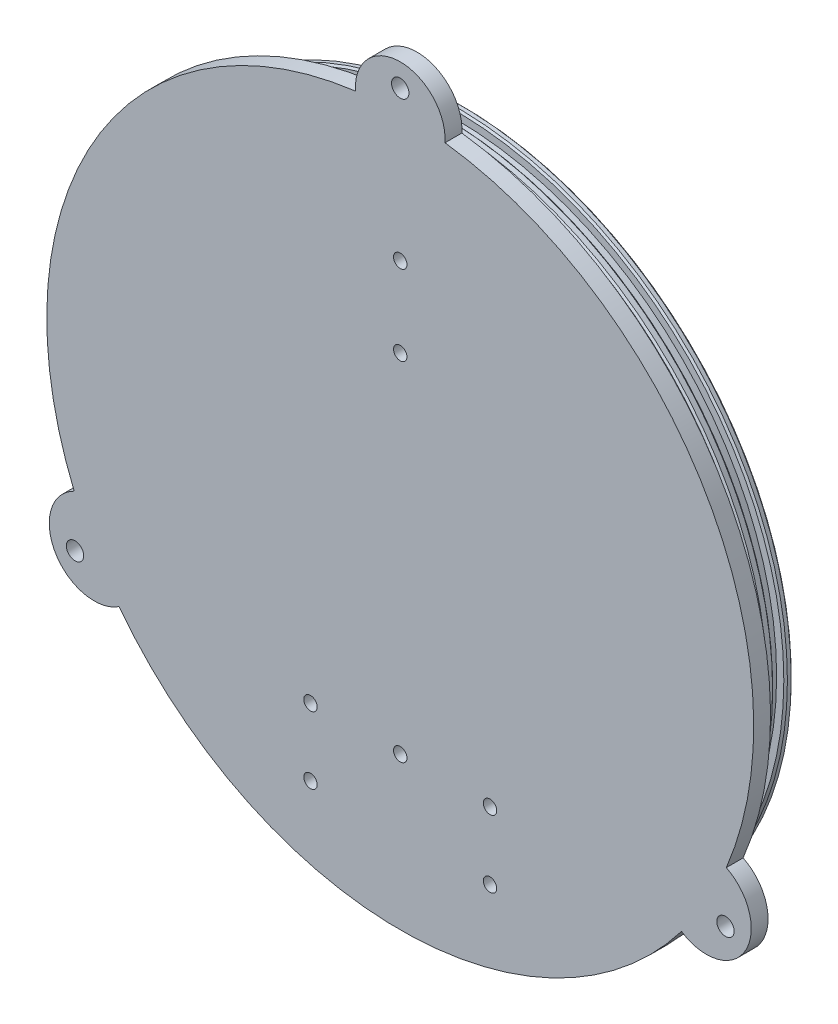
ISO-10303-21;
HEADER;
FILE_DESCRIPTION(('STEP AP214'),'2;1');
FILE_NAME('part.step','',(''),(''),'','','');
FILE_SCHEMA(('AUTOMOTIVE_DESIGN { 1 0 10303 214 1 1 1 1 }'));
ENDSEC;
DATA;
#1=APPLICATION_CONTEXT('core data for automotive mechanical design processes');
#2=APPLICATION_PROTOCOL_DEFINITION('international standard','automotive_design',2000,#1);
#3=PRODUCT_CONTEXT('',#1,'mechanical');
#4=PRODUCT('Part','Part','',(#3));
#5=PRODUCT_RELATED_PRODUCT_CATEGORY('part','',(#4));
#6=PRODUCT_DEFINITION_FORMATION('','',#4);
#7=PRODUCT_DEFINITION_CONTEXT('part definition',#1,'design');
#8=PRODUCT_DEFINITION('design','',#6,#7);
#9=PRODUCT_DEFINITION_SHAPE('','',#8);
#10=(LENGTH_UNIT() NAMED_UNIT(*) SI_UNIT(.MILLI.,.METRE.));
#11=(NAMED_UNIT(*) PLANE_ANGLE_UNIT() SI_UNIT($,.RADIAN.));
#12=(NAMED_UNIT(*) SI_UNIT($,.STERADIAN.) SOLID_ANGLE_UNIT());
#13=UNCERTAINTY_MEASURE_WITH_UNIT(LENGTH_MEASURE(1.E-05),#10,'distance_accuracy_value','');
#14=(GEOMETRIC_REPRESENTATION_CONTEXT(3) GLOBAL_UNCERTAINTY_ASSIGNED_CONTEXT((#13)) GLOBAL_UNIT_ASSIGNED_CONTEXT((#10,
#11,#12)) REPRESENTATION_CONTEXT('',''));
#15=CARTESIAN_POINT('',(0.,0.,0.));
#16=DIRECTION('',(0.,0.,1.));
#17=DIRECTION('',(1.,0.,0.));
#18=AXIS2_PLACEMENT_3D('',#15,#16,#17);
#19=CARTESIAN_POINT('',(0.,0.,4.7625));
#20=DIRECTION('',(0.,0.,-1.));
#21=DIRECTION('',(-1.,0.,0.));
#22=AXIS2_PLACEMENT_3D('',#19,#20,#21);
#23=CYLINDRICAL_SURFACE('',#22,100.0125);
#24=CARTESIAN_POINT('',(0.,0.,0.));
#25=DIRECTION('',(0.,0.,1.));
#26=DIRECTION('',(1.,0.,0.));
#27=AXIS2_PLACEMENT_3D('',#24,#25,#26);
#28=CIRCLE('',#27,100.0125);
#29=CARTESIAN_POINT('',(-12.6743757620413,99.2061507936508,0.));
#30=VERTEX_POINT('',#29);
#31=CARTESIAN_POINT('',(-92.252234679992,-38.6267440097877,0.));
#32=VERTEX_POINT('',#31);
#33=EDGE_CURVE('E103',#30,#32,#28,.T.);
#34=ORIENTED_EDGE('',*,*,#33,.T.);
#35=DIRECTION('',(0.,0.,1.));
#36=VECTOR('',#35,1.);
#37=CARTESIAN_POINT('',(-92.252234679992,-38.6267440097877,-31.1337893054916));
#38=LINE('',#37,#36);
#39=CARTESIAN_POINT('',(-92.252234679992,-38.6267440097877,4.7625));
#40=VERTEX_POINT('',#39);
#41=EDGE_CURVE('E91',#32,#40,#38,.T.);
#42=ORIENTED_EDGE('',*,*,#41,.T.);
#43=CARTESIAN_POINT('',(0.,0.,4.7625));
#44=DIRECTION('',(0.,0.,1.));
#45=DIRECTION('',(1.,0.,0.));
#46=AXIS2_PLACEMENT_3D('',#43,#44,#45);
#47=CIRCLE('',#46,100.0125);
#48=CARTESIAN_POINT('',(-12.6743757620412,99.2061507936508,4.7625));
#49=VERTEX_POINT('',#48);
#50=EDGE_CURVE('E101',#49,#40,#47,.T.);
#51=ORIENTED_EDGE('',*,*,#50,.F.);
#52=DIRECTION('',(0.,0.,1.));
#53=VECTOR('',#52,1.);
#54=CARTESIAN_POINT('',(-12.6743757620413,99.2061507936508,-31.1337893054916));
#55=LINE('',#54,#53);
#56=EDGE_CURVE('E148',#30,#49,#55,.T.);
#57=ORIENTED_EDGE('',*,*,#56,.F.);
#58=EDGE_LOOP('',(#34,#42,#51,#57));
#59=FACE_BOUND('',#58,.T.);
#60=ADVANCED_FACE('F36',(#59),#23,.T.);
#61=CARTESIAN_POINT('',(-79.5778589179509,-60.5794067838627,4.7625));
#62=VERTEX_POINT('',#61);
#63=CARTESIAN_POINT('',(79.5778589179508,-60.5794067838627,4.7625));
#64=VERTEX_POINT('',#63);
#65=EDGE_CURVE('E110',#62,#64,#47,.T.);
#66=ORIENTED_EDGE('',*,*,#65,.F.);
#67=DIRECTION('',(0.,0.,1.));
#68=VECTOR('',#67,1.);
#69=CARTESIAN_POINT('',(-79.5778589179508,-60.5794067838627,-31.1337893054916));
#70=LINE('',#69,#68);
#71=CARTESIAN_POINT('',(-79.5778589179508,-60.5794067838627,0.));
#72=VERTEX_POINT('',#71);
#73=EDGE_CURVE('E94',#72,#62,#70,.T.);
#74=ORIENTED_EDGE('',*,*,#73,.F.);
#75=CARTESIAN_POINT('',(79.5778589179508,-60.5794067838627,0.));
#76=VERTEX_POINT('',#75);
#77=EDGE_CURVE('E118',#72,#76,#28,.T.);
#78=ORIENTED_EDGE('',*,*,#77,.T.);
#79=DIRECTION('',(0.,0.,1.));
#80=VECTOR('',#79,1.);
#81=CARTESIAN_POINT('',(79.5778589179508,-60.5794067838627,-31.1337893054916));
#82=LINE('',#81,#80);
#83=EDGE_CURVE('E157',#76,#64,#82,.T.);
#84=ORIENTED_EDGE('',*,*,#83,.T.);
#85=EDGE_LOOP('',(#66,#74,#78,#84));
#86=FACE_BOUND('',#85,.T.);
#87=ADVANCED_FACE('F285',(#86),#23,.T.);
#88=CARTESIAN_POINT('',(0.,0.,-12.7));
#89=DIRECTION('',(0.,0.,1.));
#90=DIRECTION('',(1.,0.,0.));
#91=AXIS2_PLACEMENT_3D('',#88,#89,#90);
#92=CYLINDRICAL_SURFACE('',#91,93.6625);
#93=CARTESIAN_POINT('',(0.,0.,-6.93292340913388));
#94=DIRECTION('',(0.,0.,-1.));
#95=DIRECTION('',(-1.,0.,0.));
#96=AXIS2_PLACEMENT_3D('',#93,#94,#95);
#97=CIRCLE('',#96,93.6625);
#98=CARTESIAN_POINT('',(-93.6625,0.,-6.93292340913388));
#99=VERTEX_POINT('',#98);
#100=EDGE_CURVE('E365',#99,#99,#97,.F.);
#101=ORIENTED_EDGE('',*,*,#100,.T.);
#102=EDGE_LOOP('',(#101));
#103=FACE_BOUND('',#102,.T.);
#104=CARTESIAN_POINT('',(0.,0.,-5.49135892581057));
#105=DIRECTION('',(0.,0.,1.));
#106=DIRECTION('',(1.,0.,0.));
#107=AXIS2_PLACEMENT_3D('',#104,#105,#106);
#108=CIRCLE('',#107,93.6625);
#109=CARTESIAN_POINT('',(93.6625,0.,-5.49135892581057));
#110=VERTEX_POINT('',#109);
#111=EDGE_CURVE('E362',#110,#110,#108,.F.);
#112=ORIENTED_EDGE('',*,*,#111,.T.);
#113=EDGE_LOOP('',(#112));
#114=FACE_BOUND('',#113,.T.);
#115=ADVANCED_FACE('F278',(#103,#114),#92,.T.);
#116=CARTESIAN_POINT('',(0.,0.,-1.30035892581059));
#117=DIRECTION('',(0.,0.,-1.));
#118=DIRECTION('',(-1.,0.,0.));
#119=AXIS2_PLACEMENT_3D('',#116,#117,#118);
#120=CIRCLE('',#119,93.6625);
#121=CARTESIAN_POINT('',(-93.6625,0.,-1.30035892581059));
#122=VERTEX_POINT('',#121);
#123=EDGE_CURVE('E45',#122,#122,#120,.F.);
#124=ORIENTED_EDGE('',*,*,#123,.T.);
#125=EDGE_LOOP('',(#124));
#126=FACE_BOUND('',#125,.T.);
#127=CARTESIAN_POINT('',(0.,0.,0.));
#128=DIRECTION('',(0.,0.,1.));
#129=DIRECTION('',(1.,0.,0.));
#130=AXIS2_PLACEMENT_3D('',#127,#128,#129);
#131=CIRCLE('',#130,93.6625);
#132=CARTESIAN_POINT('',(93.6625,0.,0.));
#133=VERTEX_POINT('',#132);
#134=EDGE_CURVE('E109',#133,#133,#131,.F.);
#135=ORIENTED_EDGE('',*,*,#134,.T.);
#136=EDGE_LOOP('',(#135));
#137=FACE_BOUND('',#136,.T.);
#138=ADVANCED_FACE('F271',(#126,#137),#92,.T.);
#139=CARTESIAN_POINT('',(0.,0.,0.));
#140=DIRECTION('',(0.,0.,1.));
#141=DIRECTION('',(1.,0.,0.));
#142=AXIS2_PLACEMENT_3D('',#139,#140,#141);
#143=PLANE('',#142);
#144=CARTESIAN_POINT('',(0.,106.255823369828,0.));
#145=DIRECTION('',(0.,0.,1.));
#146=DIRECTION('',(1.,0.,0.));
#147=AXIS2_PLACEMENT_3D('',#144,#145,#146);
#148=CIRCLE('',#147,2.45744999999997);
#149=CARTESIAN_POINT('',(2.45744999999997,106.255823369828,0.));
#150=VERTEX_POINT('',#149);
#151=EDGE_CURVE('E176',#150,#150,#148,.T.);
#152=ORIENTED_EDGE('',*,*,#151,.T.);
#153=EDGE_LOOP('',(#152));
#154=FACE_BOUND('',#153,.T.);
#155=CARTESIAN_POINT('',(-92.0202423383029,-53.1279116849138,0.));
#156=DIRECTION('',(0.,0.,1.));
#157=DIRECTION('',(1.,0.,0.));
#158=AXIS2_PLACEMENT_3D('',#155,#156,#157);
#159=CIRCLE('',#158,2.45744999999997);
#160=CARTESIAN_POINT('',(-89.562792338303,-53.1279116849138,0.));
#161=VERTEX_POINT('',#160);
#162=EDGE_CURVE('E170',#161,#161,#159,.T.);
#163=ORIENTED_EDGE('',*,*,#162,.T.);
#164=EDGE_LOOP('',(#163));
#165=FACE_BOUND('',#164,.T.);
#166=CARTESIAN_POINT('',(92.0202423383029,-53.1279116849139,0.));
#167=DIRECTION('',(0.,0.,1.));
#168=DIRECTION('',(1.,0.,0.));
#169=AXIS2_PLACEMENT_3D('',#166,#167,#168);
#170=CIRCLE('',#169,2.45744999999997);
#171=CARTESIAN_POINT('',(94.4776923383029,-53.1279116849139,0.));
#172=VERTEX_POINT('',#171);
#173=EDGE_CURVE('E96',#172,#172,#170,.T.);
#174=ORIENTED_EDGE('',*,*,#173,.T.);
#175=EDGE_LOOP('',(#174));
#176=FACE_BOUND('',#175,.T.);
#177=ORIENTED_EDGE('',*,*,#33,.F.);
#178=CARTESIAN_POINT('',(0.,100.0125,0.));
#179=DIRECTION('',(0.,0.,1.));
#180=DIRECTION('',(1.,0.,0.));
#181=AXIS2_PLACEMENT_3D('',#178,#179,#180);
#182=CIRCLE('',#181,12.7);
#183=CARTESIAN_POINT('',(12.6743757620413,99.2061507936508,0.));
#184=VERTEX_POINT('',#183);
#185=EDGE_CURVE('E146',#30,#184,#182,.F.);
#186=ORIENTED_EDGE('',*,*,#185,.T.);
#187=CARTESIAN_POINT('',(92.2522346799921,-38.6267440097876,0.));
#188=VERTEX_POINT('',#187);
#189=EDGE_CURVE('E119',#188,#184,#28,.T.);
#190=ORIENTED_EDGE('',*,*,#189,.F.);
#191=CARTESIAN_POINT('',(86.6133656959913,-50.0062499999998,0.));
#192=DIRECTION('',(0.,0.,1.));
#193=DIRECTION('',(1.,0.,0.));
#194=AXIS2_PLACEMENT_3D('',#191,#192,#193);
#195=CIRCLE('',#194,12.7);
#196=EDGE_CURVE('E153',#188,#76,#195,.F.);
#197=ORIENTED_EDGE('',*,*,#196,.T.);
#198=ORIENTED_EDGE('',*,*,#77,.F.);
#199=CARTESIAN_POINT('',(-86.6133656959913,-50.0062499999998,0.));
#200=DIRECTION('',(0.,0.,1.));
#201=DIRECTION('',(1.,0.,0.));
#202=AXIS2_PLACEMENT_3D('',#199,#200,#201);
#203=CIRCLE('',#202,12.7);
#204=EDGE_CURVE('E162',#72,#32,#203,.F.);
#205=ORIENTED_EDGE('',*,*,#204,.T.);
#206=EDGE_LOOP('',(#177,#186,#190,#197,#198,#205));
#207=FACE_BOUND('',#206,.T.);
#208=ORIENTED_EDGE('',*,*,#134,.F.);
#209=EDGE_LOOP('',(#208));
#210=FACE_BOUND('',#209,.T.);
#211=ADVANCED_FACE('F268',(#154,#165,#176,#207,#210),#143,.F.);
#212=CARTESIAN_POINT('',(92.252234679992,-38.6267440097877,4.7625));
#213=VERTEX_POINT('',#212);
#214=CARTESIAN_POINT('',(12.6743757620413,99.2061507936508,4.7625));
#215=VERTEX_POINT('',#214);
#216=EDGE_CURVE('E112',#213,#215,#47,.T.);
#217=ORIENTED_EDGE('',*,*,#216,.F.);
#218=DIRECTION('',(0.,0.,1.));
#219=VECTOR('',#218,1.);
#220=CARTESIAN_POINT('',(92.2522346799921,-38.6267440097876,-31.1337893054916));
#221=LINE('',#220,#219);
#222=EDGE_CURVE('E156',#188,#213,#221,.T.);
#223=ORIENTED_EDGE('',*,*,#222,.F.);
#224=ORIENTED_EDGE('',*,*,#189,.T.);
#225=DIRECTION('',(0.,0.,1.));
#226=VECTOR('',#225,1.);
#227=CARTESIAN_POINT('',(12.6743757620413,99.2061507936508,-31.1337893054916));
#228=LINE('',#227,#226);
#229=EDGE_CURVE('E149',#184,#215,#228,.T.);
#230=ORIENTED_EDGE('',*,*,#229,.T.);
#231=EDGE_LOOP('',(#217,#223,#224,#230));
#232=FACE_BOUND('',#231,.T.);
#233=ADVANCED_FACE('F38',(#232),#23,.T.);
#234=CARTESIAN_POINT('',(0.,0.,4.7625));
#235=DIRECTION('',(0.,0.,1.));
#236=DIRECTION('',(1.,0.,0.));
#237=AXIS2_PLACEMENT_3D('',#234,#235,#236);
#238=PLANE('',#237);
#239=CARTESIAN_POINT('',(25.4,-57.15,4.7625));
#240=DIRECTION('',(0.,0.,1.));
#241=DIRECTION('',(1.,0.,0.));
#242=AXIS2_PLACEMENT_3D('',#239,#240,#241);
#243=CIRCLE('',#242,1.89865);
#244=CARTESIAN_POINT('',(27.29865,-57.15,4.7625));
#245=VERTEX_POINT('',#244);
#246=EDGE_CURVE('E205',#245,#245,#243,.T.);
#247=ORIENTED_EDGE('',*,*,#246,.F.);
#248=EDGE_LOOP('',(#247));
#249=FACE_BOUND('',#248,.T.);
#250=CARTESIAN_POINT('',(-25.4,-57.15,4.7625));
#251=DIRECTION('',(0.,0.,1.));
#252=DIRECTION('',(1.,0.,0.));
#253=AXIS2_PLACEMENT_3D('',#250,#251,#252);
#254=CIRCLE('',#253,1.89865);
#255=CARTESIAN_POINT('',(-23.50135,-57.15,4.7625));
#256=VERTEX_POINT('',#255);
#257=EDGE_CURVE('E199',#256,#256,#254,.T.);
#258=ORIENTED_EDGE('',*,*,#257,.F.);
#259=EDGE_LOOP('',(#258));
#260=FACE_BOUND('',#259,.T.);
#261=CARTESIAN_POINT('',(25.4,-76.2,4.7625));
#262=DIRECTION('',(0.,0.,1.));
#263=DIRECTION('',(1.,0.,0.));
#264=AXIS2_PLACEMENT_3D('',#261,#262,#263);
#265=CIRCLE('',#264,1.89865);
#266=CARTESIAN_POINT('',(27.29865,-76.2,4.7625));
#267=VERTEX_POINT('',#266);
#268=EDGE_CURVE('E40',#267,#267,#265,.T.);
#269=ORIENTED_EDGE('',*,*,#268,.F.);
#270=EDGE_LOOP('',(#269));
#271=FACE_BOUND('',#270,.T.);
#272=CARTESIAN_POINT('',(-25.4,-76.2,4.7625));
#273=DIRECTION('',(0.,0.,1.));
#274=DIRECTION('',(1.,0.,0.));
#275=AXIS2_PLACEMENT_3D('',#272,#273,#274);
#276=CIRCLE('',#275,1.89865);
#277=CARTESIAN_POINT('',(-23.50135,-76.2,4.7625));
#278=VERTEX_POINT('',#277);
#279=EDGE_CURVE('E192',#278,#278,#276,.T.);
#280=ORIENTED_EDGE('',*,*,#279,.F.);
#281=EDGE_LOOP('',(#280));
#282=FACE_BOUND('',#281,.T.);
#283=CARTESIAN_POINT('',(0.,63.9527832109796,4.7625));
#284=DIRECTION('',(0.,0.,1.));
#285=DIRECTION('',(1.,0.,0.));
#286=AXIS2_PLACEMENT_3D('',#283,#284,#285);
#287=CIRCLE('',#286,1.89865);
#288=CARTESIAN_POINT('',(1.89864999999998,63.9527832109796,4.7625));
#289=VERTEX_POINT('',#288);
#290=EDGE_CURVE('E189',#289,#289,#287,.T.);
#291=ORIENTED_EDGE('',*,*,#290,.F.);
#292=EDGE_LOOP('',(#291));
#293=FACE_BOUND('',#292,.T.);
#294=CARTESIAN_POINT('',(0.,41.3467832109796,4.7625));
#295=DIRECTION('',(0.,0.,1.));
#296=DIRECTION('',(1.,0.,0.));
#297=AXIS2_PLACEMENT_3D('',#294,#295,#296);
#298=CIRCLE('',#297,1.89865);
#299=CARTESIAN_POINT('',(1.89864999999997,41.3467832109796,4.7625));
#300=VERTEX_POINT('',#299);
#301=EDGE_CURVE('E185',#300,#300,#298,.T.);
#302=ORIENTED_EDGE('',*,*,#301,.F.);
#303=EDGE_LOOP('',(#302));
#304=FACE_BOUND('',#303,.T.);
#305=CARTESIAN_POINT('',(0.,-56.9512167890204,4.7625));
#306=DIRECTION('',(0.,0.,1.));
#307=DIRECTION('',(1.,0.,0.));
#308=AXIS2_PLACEMENT_3D('',#305,#306,#307);
#309=CIRCLE('',#308,1.89865);
#310=CARTESIAN_POINT('',(1.89864999999991,-56.9512167890204,4.7625));
#311=VERTEX_POINT('',#310);
#312=EDGE_CURVE('E181',#311,#311,#309,.T.);
#313=ORIENTED_EDGE('',*,*,#312,.F.);
#314=EDGE_LOOP('',(#313));
#315=FACE_BOUND('',#314,.T.);
#316=CARTESIAN_POINT('',(0.,106.255823369828,4.7625));
#317=DIRECTION('',(0.,0.,1.));
#318=DIRECTION('',(1.,0.,0.));
#319=AXIS2_PLACEMENT_3D('',#316,#317,#318);
#320=CIRCLE('',#319,2.45744999999999);
#321=CARTESIAN_POINT('',(2.45744999999999,106.255823369828,4.7625));
#322=VERTEX_POINT('',#321);
#323=EDGE_CURVE('E177',#322,#322,#320,.T.);
#324=ORIENTED_EDGE('',*,*,#323,.F.);
#325=EDGE_LOOP('',(#324));
#326=FACE_BOUND('',#325,.T.);
#327=CARTESIAN_POINT('',(-92.0202423383029,-53.1279116849138,4.7625));
#328=DIRECTION('',(0.,0.,1.));
#329=DIRECTION('',(1.,0.,0.));
#330=AXIS2_PLACEMENT_3D('',#327,#328,#329);
#331=CIRCLE('',#330,2.45744999999999);
#332=CARTESIAN_POINT('',(-89.5627923383029,-53.1279116849138,4.7625));
#333=VERTEX_POINT('',#332);
#334=EDGE_CURVE('E173',#333,#333,#331,.T.);
#335=ORIENTED_EDGE('',*,*,#334,.F.);
#336=EDGE_LOOP('',(#335));
#337=FACE_BOUND('',#336,.T.);
#338=CARTESIAN_POINT('',(92.0202423383029,-53.1279116849139,4.7625));
#339=DIRECTION('',(0.,0.,1.));
#340=DIRECTION('',(1.,0.,0.));
#341=AXIS2_PLACEMENT_3D('',#338,#339,#340);
#342=CIRCLE('',#341,2.45744999999999);
#343=CARTESIAN_POINT('',(94.4776923383029,-53.1279116849139,4.7625));
#344=VERTEX_POINT('',#343);
#345=EDGE_CURVE('E167',#344,#344,#342,.T.);
#346=ORIENTED_EDGE('',*,*,#345,.F.);
#347=EDGE_LOOP('',(#346));
#348=FACE_BOUND('',#347,.T.);
#349=ORIENTED_EDGE('',*,*,#50,.T.);
#350=CARTESIAN_POINT('',(-86.6133656959913,-50.0062499999998,4.7625));
#351=DIRECTION('',(0.,0.,1.));
#352=DIRECTION('',(-1.,0.,0.));
#353=AXIS2_PLACEMENT_3D('',#350,#351,#352);
#354=CIRCLE('',#353,12.7);
#355=EDGE_CURVE('E53',#40,#62,#354,.T.);
#356=ORIENTED_EDGE('',*,*,#355,.T.);
#357=ORIENTED_EDGE('',*,*,#65,.T.);
#358=CARTESIAN_POINT('',(86.6133656959913,-50.0062499999998,4.7625));
#359=DIRECTION('',(0.,0.,1.));
#360=DIRECTION('',(-1.,0.,0.));
#361=AXIS2_PLACEMENT_3D('',#358,#359,#360);
#362=CIRCLE('',#361,12.7);
#363=EDGE_CURVE('E59',#64,#213,#362,.T.);
#364=ORIENTED_EDGE('',*,*,#363,.T.);
#365=ORIENTED_EDGE('',*,*,#216,.T.);
#366=CARTESIAN_POINT('',(0.,100.0125,4.7625));
#367=DIRECTION('',(0.,0.,1.));
#368=DIRECTION('',(-1.,0.,0.));
#369=AXIS2_PLACEMENT_3D('',#366,#367,#368);
#370=CIRCLE('',#369,12.7);
#371=EDGE_CURVE('E107',#215,#49,#370,.T.);
#372=ORIENTED_EDGE('',*,*,#371,.T.);
#373=EDGE_LOOP('',(#349,#356,#357,#364,#365,#372));
#374=FACE_BOUND('',#373,.T.);
#375=ADVANCED_FACE('F105',(#249,#260,#271,#282,#293,#304,#315,#326,#337,#348,#374),#238,.T.);
#376=CARTESIAN_POINT('',(0.,93.6625,-1.80835892581058));
#377=DIRECTION('',(0.,0.,-1.));
#378=DIRECTION('',(-1.,0.,0.));
#379=AXIS2_PLACEMENT_3D('',#376,#377,#378);
#380=PLANE('',#379);
#381=CARTESIAN_POINT('',(0.,0.,-1.80835892581058));
#382=DIRECTION('',(0.,0.,-1.));
#383=DIRECTION('',(-1.,0.,0.));
#384=AXIS2_PLACEMENT_3D('',#381,#382,#383);
#385=CIRCLE('',#384,93.1545);
#386=CARTESIAN_POINT('',(-93.1545,0.,-1.80835892581058));
#387=VERTEX_POINT('',#386);
#388=EDGE_CURVE('E11',#387,#387,#385,.T.);
#389=ORIENTED_EDGE('',*,*,#388,.T.);
#390=EDGE_LOOP('',(#389));
#391=FACE_BOUND('',#390,.T.);
#392=CARTESIAN_POINT('',(0.,0.,-1.80835892581058));
#393=DIRECTION('',(0.,0.,1.));
#394=DIRECTION('',(1.,0.,0.));
#395=AXIS2_PLACEMENT_3D('',#392,#393,#394);
#396=CIRCLE('',#395,91.1225);
#397=CARTESIAN_POINT('',(91.1225,0.,-1.80835892581058));
#398=VERTEX_POINT('',#397);
#399=EDGE_CURVE('E132',#398,#398,#396,.T.);
#400=ORIENTED_EDGE('',*,*,#399,.T.);
#401=EDGE_LOOP('',(#400));
#402=FACE_BOUND('',#401,.T.);
#403=ADVANCED_FACE('F247',(#391,#402),#380,.T.);
#404=CARTESIAN_POINT('',(0.,0.,0.));
#405=DIRECTION('',(0.,0.,1.));
#406=DIRECTION('',(1.,0.,0.));
#407=AXIS2_PLACEMENT_3D('',#404,#405,#406);
#408=CYLINDRICAL_SURFACE('',#407,91.1225);
#409=CARTESIAN_POINT('',(0.,0.,-4.98335892581058));
#410=DIRECTION('',(0.,0.,1.));
#411=DIRECTION('',(1.,0.,0.));
#412=AXIS2_PLACEMENT_3D('',#409,#410,#411);
#413=CIRCLE('',#412,91.1225);
#414=CARTESIAN_POINT('',(91.1225,0.,-4.98335892581058));
#415=VERTEX_POINT('',#414);
#416=EDGE_CURVE('E137',#415,#415,#413,.T.);
#417=ORIENTED_EDGE('',*,*,#416,.T.);
#418=EDGE_LOOP('',(#417));
#419=FACE_BOUND('',#418,.T.);
#420=ORIENTED_EDGE('',*,*,#399,.F.);
#421=EDGE_LOOP('',(#420));
#422=FACE_BOUND('',#421,.T.);
#423=ADVANCED_FACE('F330',(#419,#422),#408,.T.);
#424=CARTESIAN_POINT('',(0.,93.6625,-4.98335892581058));
#425=DIRECTION('',(0.,0.,1.));
#426=DIRECTION('',(1.,0.,0.));
#427=AXIS2_PLACEMENT_3D('',#424,#425,#426);
#428=PLANE('',#427);
#429=CARTESIAN_POINT('',(0.,0.,-4.98335892581058));
#430=DIRECTION('',(0.,0.,1.));
#431=DIRECTION('',(1.,0.,0.));
#432=AXIS2_PLACEMENT_3D('',#429,#430,#431);
#433=CIRCLE('',#432,93.1545);
#434=CARTESIAN_POINT('',(93.1545,0.,-4.98335892581058));
#435=VERTEX_POINT('',#434);
#436=EDGE_CURVE('E371',#435,#435,#433,.T.);
#437=ORIENTED_EDGE('',*,*,#436,.T.);
#438=EDGE_LOOP('',(#437));
#439=FACE_BOUND('',#438,.T.);
#440=ORIENTED_EDGE('',*,*,#416,.F.);
#441=EDGE_LOOP('',(#440));
#442=FACE_BOUND('',#441,.T.);
#443=ADVANCED_FACE('F326',(#439,#442),#428,.T.);
#444=CARTESIAN_POINT('',(0.,93.6625,-7.44092340913388));
#445=DIRECTION('',(0.,0.,-1.));
#446=DIRECTION('',(-1.,0.,0.));
#447=AXIS2_PLACEMENT_3D('',#444,#445,#446);
#448=PLANE('',#447);
#449=CARTESIAN_POINT('',(0.,0.,-7.44092340913388));
#450=DIRECTION('',(0.,0.,-1.));
#451=DIRECTION('',(-1.,0.,0.));
#452=AXIS2_PLACEMENT_3D('',#449,#450,#451);
#453=CIRCLE('',#452,93.1545);
#454=CARTESIAN_POINT('',(-93.1545,0.,-7.44092340913388));
#455=VERTEX_POINT('',#454);
#456=EDGE_CURVE('E368',#455,#455,#453,.T.);
#457=ORIENTED_EDGE('',*,*,#456,.T.);
#458=EDGE_LOOP('',(#457));
#459=FACE_BOUND('',#458,.T.);
#460=CARTESIAN_POINT('',(0.,0.,-7.44092340913388));
#461=DIRECTION('',(0.,0.,1.));
#462=DIRECTION('',(1.,0.,0.));
#463=AXIS2_PLACEMENT_3D('',#460,#461,#462);
#464=CIRCLE('',#463,91.1225);
#465=CARTESIAN_POINT('',(91.1225,0.,-7.44092340913388));
#466=VERTEX_POINT('',#465);
#467=EDGE_CURVE('E140',#466,#466,#464,.T.);
#468=ORIENTED_EDGE('',*,*,#467,.T.);
#469=EDGE_LOOP('',(#468));
#470=FACE_BOUND('',#469,.T.);
#471=ADVANCED_FACE('F322',(#459,#470),#448,.T.);
#472=CARTESIAN_POINT('',(0.,0.,0.));
#473=DIRECTION('',(0.,0.,1.));
#474=DIRECTION('',(1.,0.,0.));
#475=AXIS2_PLACEMENT_3D('',#472,#473,#474);
#476=CYLINDRICAL_SURFACE('',#475,91.1225);
#477=CARTESIAN_POINT('',(0.,0.,-10.6159234091339));
#478=DIRECTION('',(0.,0.,1.));
#479=DIRECTION('',(1.,0.,0.));
#480=AXIS2_PLACEMENT_3D('',#477,#478,#479);
#481=CIRCLE('',#480,91.1225);
#482=CARTESIAN_POINT('',(91.1225,0.,-10.6159234091339));
#483=VERTEX_POINT('',#482);
#484=EDGE_CURVE('E143',#483,#483,#481,.T.);
#485=ORIENTED_EDGE('',*,*,#484,.T.);
#486=EDGE_LOOP('',(#485));
#487=FACE_BOUND('',#486,.T.);
#488=ORIENTED_EDGE('',*,*,#467,.F.);
#489=EDGE_LOOP('',(#488));
#490=FACE_BOUND('',#489,.T.);
#491=ADVANCED_FACE('F318',(#487,#490),#476,.T.);
#492=CARTESIAN_POINT('',(0.,93.6625,-10.6159234091339));
#493=DIRECTION('',(0.,0.,1.));
#494=DIRECTION('',(1.,0.,0.));
#495=AXIS2_PLACEMENT_3D('',#492,#493,#494);
#496=PLANE('',#495);
#497=CARTESIAN_POINT('',(0.,0.,-10.6159234091339));
#498=DIRECTION('',(0.,0.,1.));
#499=DIRECTION('',(1.,0.,0.));
#500=AXIS2_PLACEMENT_3D('',#497,#498,#499);
#501=CIRCLE('',#500,93.1545000000001);
#502=CARTESIAN_POINT('',(93.1545000000001,0.,-10.6159234091339));
#503=VERTEX_POINT('',#502);
#504=EDGE_CURVE('E359',#503,#503,#501,.T.);
#505=ORIENTED_EDGE('',*,*,#504,.T.);
#506=EDGE_LOOP('',(#505));
#507=FACE_BOUND('',#506,.T.);
#508=ORIENTED_EDGE('',*,*,#484,.F.);
#509=EDGE_LOOP('',(#508));
#510=FACE_BOUND('',#509,.T.);
#511=ADVANCED_FACE('F218',(#507,#510),#496,.T.);
#512=CARTESIAN_POINT('',(0.,0.,0.));
#513=DIRECTION('',(0.,0.,-1.));
#514=DIRECTION('',(-1.,0.,0.));
#515=AXIS2_PLACEMENT_3D('',#512,#513,#514);
#516=PLANE('',#515);
#517=CARTESIAN_POINT('',(25.4,-57.15,0.));
#518=DIRECTION('',(0.,0.,-1.));
#519=DIRECTION('',(-1.,0.,0.));
#520=AXIS2_PLACEMENT_3D('',#517,#518,#519);
#521=CIRCLE('',#520,1.89865);
#522=CARTESIAN_POINT('',(23.50135,-57.15,0.));
#523=VERTEX_POINT('',#522);
#524=EDGE_CURVE('E208',#523,#523,#521,.T.);
#525=ORIENTED_EDGE('',*,*,#524,.F.);
#526=EDGE_LOOP('',(#525));
#527=FACE_BOUND('',#526,.T.);
#528=CARTESIAN_POINT('',(-25.4,-57.15,0.));
#529=DIRECTION('',(0.,0.,-1.));
#530=DIRECTION('',(-1.,0.,0.));
#531=AXIS2_PLACEMENT_3D('',#528,#529,#530);
#532=CIRCLE('',#531,1.89865);
#533=CARTESIAN_POINT('',(-27.29865,-57.15,0.));
#534=VERTEX_POINT('',#533);
#535=EDGE_CURVE('E202',#534,#534,#532,.T.);
#536=ORIENTED_EDGE('',*,*,#535,.F.);
#537=EDGE_LOOP('',(#536));
#538=FACE_BOUND('',#537,.T.);
#539=CARTESIAN_POINT('',(25.4,-76.2,0.));
#540=DIRECTION('',(0.,0.,-1.));
#541=DIRECTION('',(-1.,0.,0.));
#542=AXIS2_PLACEMENT_3D('',#539,#540,#541);
#543=CIRCLE('',#542,1.89865);
#544=CARTESIAN_POINT('',(23.50135,-76.2,0.));
#545=VERTEX_POINT('',#544);
#546=EDGE_CURVE('E196',#545,#545,#543,.T.);
#547=ORIENTED_EDGE('',*,*,#546,.F.);
#548=EDGE_LOOP('',(#547));
#549=FACE_BOUND('',#548,.T.);
#550=CARTESIAN_POINT('',(-25.4,-76.2,0.));
#551=DIRECTION('',(0.,0.,-1.));
#552=DIRECTION('',(-1.,0.,0.));
#553=AXIS2_PLACEMENT_3D('',#550,#551,#552);
#554=CIRCLE('',#553,1.89865);
#555=CARTESIAN_POINT('',(-27.29865,-76.2,0.));
#556=VERTEX_POINT('',#555);
#557=EDGE_CURVE('E193',#556,#556,#554,.T.);
#558=ORIENTED_EDGE('',*,*,#557,.F.);
#559=EDGE_LOOP('',(#558));
#560=FACE_BOUND('',#559,.T.);
#561=CARTESIAN_POINT('',(0.,63.9527832109796,0.));
#562=DIRECTION('',(0.,0.,-1.));
#563=DIRECTION('',(-1.,0.,0.));
#564=AXIS2_PLACEMENT_3D('',#561,#562,#563);
#565=CIRCLE('',#564,1.89865);
#566=CARTESIAN_POINT('',(-1.89865000000002,63.9527832109796,0.));
#567=VERTEX_POINT('',#566);
#568=EDGE_CURVE('E188',#567,#567,#565,.T.);
#569=ORIENTED_EDGE('',*,*,#568,.F.);
#570=EDGE_LOOP('',(#569));
#571=FACE_BOUND('',#570,.T.);
#572=CARTESIAN_POINT('',(0.,41.3467832109796,0.));
#573=DIRECTION('',(0.,0.,-1.));
#574=DIRECTION('',(-1.,0.,0.));
#575=AXIS2_PLACEMENT_3D('',#572,#573,#574);
#576=CIRCLE('',#575,1.89865);
#577=CARTESIAN_POINT('',(-1.89865000000003,41.3467832109796,0.));
#578=VERTEX_POINT('',#577);
#579=EDGE_CURVE('E184',#578,#578,#576,.T.);
#580=ORIENTED_EDGE('',*,*,#579,.F.);
#581=EDGE_LOOP('',(#580));
#582=FACE_BOUND('',#581,.T.);
#583=CARTESIAN_POINT('',(0.,-56.9512167890204,0.));
#584=DIRECTION('',(0.,0.,-1.));
#585=DIRECTION('',(-1.,0.,0.));
#586=AXIS2_PLACEMENT_3D('',#583,#584,#585);
#587=CIRCLE('',#586,1.89865);
#588=CARTESIAN_POINT('',(-1.89865000000008,-56.9512167890204,0.));
#589=VERTEX_POINT('',#588);
#590=EDGE_CURVE('E180',#589,#589,#587,.T.);
#591=ORIENTED_EDGE('',*,*,#590,.F.);
#592=EDGE_LOOP('',(#591));
#593=FACE_BOUND('',#592,.T.);
#594=CARTESIAN_POINT('',(0.,0.,0.));
#595=DIRECTION('',(0.,0.,-1.));
#596=DIRECTION('',(-1.,0.,0.));
#597=AXIS2_PLACEMENT_3D('',#594,#595,#596);
#598=CIRCLE('',#597,87.3125);
#599=CARTESIAN_POINT('',(-87.3125,0.,0.));
#600=VERTEX_POINT('',#599);
#601=EDGE_CURVE('E121',#600,#600,#598,.T.);
#602=ORIENTED_EDGE('',*,*,#601,.T.);
#603=EDGE_LOOP('',(#602));
#604=FACE_BOUND('',#603,.T.);
#605=ADVANCED_FACE('F214',(#527,#538,#549,#560,#571,#582,#593,#604),#516,.T.);
#606=CARTESIAN_POINT('',(0.,0.,0.));
#607=DIRECTION('',(0.,0.,-1.));
#608=DIRECTION('',(-1.,0.,0.));
#609=AXIS2_PLACEMENT_3D('',#606,#607,#608);
#610=CYLINDRICAL_SURFACE('',#609,87.3125);
#611=ORIENTED_EDGE('',*,*,#601,.F.);
#612=EDGE_LOOP('',(#611));
#613=FACE_BOUND('',#612,.T.);
#614=CARTESIAN_POINT('',(0.,0.,-12.7));
#615=DIRECTION('',(0.,0.,-1.));
#616=DIRECTION('',(-1.,0.,0.));
#617=AXIS2_PLACEMENT_3D('',#614,#615,#616);
#618=CIRCLE('',#617,87.3125);
#619=CARTESIAN_POINT('',(-87.3125,0.,-12.7));
#620=VERTEX_POINT('',#619);
#621=EDGE_CURVE('E128',#620,#620,#618,.T.);
#622=ORIENTED_EDGE('',*,*,#621,.T.);
#623=EDGE_LOOP('',(#622));
#624=FACE_BOUND('',#623,.T.);
#625=ADVANCED_FACE('F217',(#613,#624),#610,.F.);
#626=CARTESIAN_POINT('',(0.,0.,-12.7));
#627=DIRECTION('',(0.,0.,-1.));
#628=DIRECTION('',(-1.,0.,0.));
#629=AXIS2_PLACEMENT_3D('',#626,#627,#628);
#630=PLANE('',#629);
#631=CARTESIAN_POINT('',(0.,0.,-12.7));
#632=DIRECTION('',(0.,0.,-1.));
#633=DIRECTION('',(-1.,0.,0.));
#634=AXIS2_PLACEMENT_3D('',#631,#632,#633);
#635=CIRCLE('',#634,93.1545);
#636=CARTESIAN_POINT('',(-93.1545,0.,-12.7));
#637=VERTEX_POINT('',#636);
#638=EDGE_CURVE('E114',#637,#637,#635,.T.);
#639=ORIENTED_EDGE('',*,*,#638,.T.);
#640=EDGE_LOOP('',(#639));
#641=FACE_BOUND('',#640,.T.);
#642=ORIENTED_EDGE('',*,*,#621,.F.);
#643=EDGE_LOOP('',(#642));
#644=FACE_BOUND('',#643,.T.);
#645=ADVANCED_FACE('F291',(#641,#644),#630,.T.);
#646=CARTESIAN_POINT('',(0.,0.,-12.1920000000001));
#647=DIRECTION('',(0.,0.,-1.));
#648=DIRECTION('',(-1.,0.,0.));
#649=AXIS2_PLACEMENT_3D('',#646,#647,#648);
#650=CIRCLE('',#649,93.6625);
#651=CARTESIAN_POINT('',(-93.6625,0.,-12.1920000000001));
#652=VERTEX_POINT('',#651);
#653=EDGE_CURVE('E353',#652,#652,#650,.F.);
#654=ORIENTED_EDGE('',*,*,#653,.T.);
#655=EDGE_LOOP('',(#654));
#656=FACE_BOUND('',#655,.T.);
#657=CARTESIAN_POINT('',(0.,0.,-11.1239234091338));
#658=DIRECTION('',(0.,0.,1.));
#659=DIRECTION('',(1.,0.,0.));
#660=AXIS2_PLACEMENT_3D('',#657,#658,#659);
#661=CIRCLE('',#660,93.6625);
#662=CARTESIAN_POINT('',(93.6625,0.,-11.1239234091338));
#663=VERTEX_POINT('',#662);
#664=EDGE_CURVE('E350',#663,#663,#661,.F.);
#665=ORIENTED_EDGE('',*,*,#664,.T.);
#666=EDGE_LOOP('',(#665));
#667=FACE_BOUND('',#666,.T.);
#668=ADVANCED_FACE('F281',(#656,#667),#92,.T.);
#669=CARTESIAN_POINT('',(0.,100.0125,-31.1337893054916));
#670=DIRECTION('',(0.,0.,1.));
#671=DIRECTION('',(1.,0.,0.));
#672=AXIS2_PLACEMENT_3D('',#669,#670,#671);
#673=CYLINDRICAL_SURFACE('',#672,12.7);
#674=ORIENTED_EDGE('',*,*,#185,.F.);
#675=ORIENTED_EDGE('',*,*,#56,.T.);
#676=ORIENTED_EDGE('',*,*,#371,.F.);
#677=ORIENTED_EDGE('',*,*,#229,.F.);
#678=EDGE_LOOP('',(#674,#675,#676,#677));
#679=FACE_BOUND('',#678,.T.);
#680=ADVANCED_FACE('F290',(#679),#673,.T.);
#681=CARTESIAN_POINT('',(86.6133656959913,-50.0062499999998,-31.1337893054916));
#682=DIRECTION('',(0.,0.,1.));
#683=DIRECTION('',(1.,0.,0.));
#684=AXIS2_PLACEMENT_3D('',#681,#682,#683);
#685=CYLINDRICAL_SURFACE('',#684,12.7);
#686=ORIENTED_EDGE('',*,*,#196,.F.);
#687=ORIENTED_EDGE('',*,*,#222,.T.);
#688=ORIENTED_EDGE('',*,*,#363,.F.);
#689=ORIENTED_EDGE('',*,*,#83,.F.);
#690=EDGE_LOOP('',(#686,#687,#688,#689));
#691=FACE_BOUND('',#690,.T.);
#692=ADVANCED_FACE('F306',(#691),#685,.T.);
#693=CARTESIAN_POINT('',(-86.6133656959913,-50.0062499999998,-31.1337893054916));
#694=DIRECTION('',(0.,0.,1.));
#695=DIRECTION('',(1.,0.,0.));
#696=AXIS2_PLACEMENT_3D('',#693,#694,#695);
#697=CYLINDRICAL_SURFACE('',#696,12.7);
#698=ORIENTED_EDGE('',*,*,#204,.F.);
#699=ORIENTED_EDGE('',*,*,#73,.T.);
#700=ORIENTED_EDGE('',*,*,#355,.F.);
#701=ORIENTED_EDGE('',*,*,#41,.F.);
#702=EDGE_LOOP('',(#698,#699,#700,#701));
#703=FACE_BOUND('',#702,.T.);
#704=ADVANCED_FACE('F90',(#703),#697,.T.);
#705=CARTESIAN_POINT('',(92.0202423383029,-53.1279116849139,4.7625));
#706=DIRECTION('',(0.,0.,1.));
#707=DIRECTION('',(1.,0.,0.));
#708=AXIS2_PLACEMENT_3D('',#705,#706,#707);
#709=CYLINDRICAL_SURFACE('',#708,2.45744999999997);
#710=ORIENTED_EDGE('',*,*,#345,.T.);
#711=EDGE_LOOP('',(#710));
#712=FACE_BOUND('',#711,.T.);
#713=ORIENTED_EDGE('',*,*,#173,.F.);
#714=EDGE_LOOP('',(#713));
#715=FACE_BOUND('',#714,.T.);
#716=ADVANCED_FACE('F261',(#712,#715),#709,.F.);
#717=CARTESIAN_POINT('',(-92.0202423383029,-53.1279116849138,4.7625));
#718=DIRECTION('',(0.,0.,1.));
#719=DIRECTION('',(1.,0.,0.));
#720=AXIS2_PLACEMENT_3D('',#717,#718,#719);
#721=CYLINDRICAL_SURFACE('',#720,2.45744999999997);
#722=ORIENTED_EDGE('',*,*,#334,.T.);
#723=EDGE_LOOP('',(#722));
#724=FACE_BOUND('',#723,.T.);
#725=ORIENTED_EDGE('',*,*,#162,.F.);
#726=EDGE_LOOP('',(#725));
#727=FACE_BOUND('',#726,.T.);
#728=ADVANCED_FACE('F264',(#724,#727),#721,.F.);
#729=CARTESIAN_POINT('',(0.,106.255823369828,4.7625));
#730=DIRECTION('',(0.,0.,1.));
#731=DIRECTION('',(1.,0.,0.));
#732=AXIS2_PLACEMENT_3D('',#729,#730,#731);
#733=CYLINDRICAL_SURFACE('',#732,2.45744999999997);
#734=ORIENTED_EDGE('',*,*,#323,.T.);
#735=EDGE_LOOP('',(#734));
#736=FACE_BOUND('',#735,.T.);
#737=ORIENTED_EDGE('',*,*,#151,.F.);
#738=EDGE_LOOP('',(#737));
#739=FACE_BOUND('',#738,.T.);
#740=ADVANCED_FACE('F403',(#736,#739),#733,.F.);
#741=CARTESIAN_POINT('',(0.,0.,-12.7));
#742=DIRECTION('',(0.,0.,1.));
#743=DIRECTION('',(1.,0.,0.));
#744=AXIS2_PLACEMENT_3D('',#741,#742,#743);
#745=CONICAL_SURFACE('',#744,93.1545,0.785398163397489);
#746=ORIENTED_EDGE('',*,*,#653,.F.);
#747=EDGE_LOOP('',(#746));
#748=FACE_BOUND('',#747,.T.);
#749=ORIENTED_EDGE('',*,*,#638,.F.);
#750=EDGE_LOOP('',(#749));
#751=FACE_BOUND('',#750,.T.);
#752=ADVANCED_FACE('F399',(#748,#751),#745,.T.);
#753=CARTESIAN_POINT('',(0.,0.,-10.6159234091339));
#754=DIRECTION('',(0.,0.,-1.));
#755=DIRECTION('',(-1.,0.,0.));
#756=AXIS2_PLACEMENT_3D('',#753,#754,#755);
#757=CONICAL_SURFACE('',#756,93.1545000000001,0.785398163397489);
#758=ORIENTED_EDGE('',*,*,#664,.F.);
#759=EDGE_LOOP('',(#758));
#760=FACE_BOUND('',#759,.T.);
#761=ORIENTED_EDGE('',*,*,#504,.F.);
#762=EDGE_LOOP('',(#761));
#763=FACE_BOUND('',#762,.T.);
#764=ADVANCED_FACE('F395',(#760,#763),#757,.T.);
#765=CARTESIAN_POINT('',(0.,0.,-6.93292340913388));
#766=DIRECTION('',(0.,0.,1.));
#767=DIRECTION('',(1.,0.,0.));
#768=AXIS2_PLACEMENT_3D('',#765,#766,#767);
#769=CONICAL_SURFACE('',#768,93.6625,0.785398163397448);
#770=ORIENTED_EDGE('',*,*,#456,.F.);
#771=EDGE_LOOP('',(#770));
#772=FACE_BOUND('',#771,.T.);
#773=ORIENTED_EDGE('',*,*,#100,.F.);
#774=EDGE_LOOP('',(#773));
#775=FACE_BOUND('',#774,.T.);
#776=ADVANCED_FACE('F387',(#772,#775),#769,.T.);
#777=CARTESIAN_POINT('',(0.,0.,-4.98335892581058));
#778=DIRECTION('',(0.,0.,-1.));
#779=DIRECTION('',(-1.,0.,0.));
#780=AXIS2_PLACEMENT_3D('',#777,#778,#779);
#781=CONICAL_SURFACE('',#780,93.1545,0.785398163397435);
#782=ORIENTED_EDGE('',*,*,#111,.F.);
#783=EDGE_LOOP('',(#782));
#784=FACE_BOUND('',#783,.T.);
#785=ORIENTED_EDGE('',*,*,#436,.F.);
#786=EDGE_LOOP('',(#785));
#787=FACE_BOUND('',#786,.T.);
#788=ADVANCED_FACE('F378',(#784,#787),#781,.T.);
#789=CARTESIAN_POINT('',(0.,0.,-1.30035892581059));
#790=DIRECTION('',(0.,0.,1.));
#791=DIRECTION('',(1.,0.,0.));
#792=AXIS2_PLACEMENT_3D('',#789,#790,#791);
#793=CONICAL_SURFACE('',#792,93.6625,0.785398163397448);
#794=ORIENTED_EDGE('',*,*,#388,.F.);
#795=EDGE_LOOP('',(#794));
#796=FACE_BOUND('',#795,.T.);
#797=ORIENTED_EDGE('',*,*,#123,.F.);
#798=EDGE_LOOP('',(#797));
#799=FACE_BOUND('',#798,.T.);
#800=ADVANCED_FACE('F375',(#796,#799),#793,.T.);
#801=CARTESIAN_POINT('',(0.,-56.9512167890204,4.7625));
#802=DIRECTION('',(0.,0.,1.));
#803=DIRECTION('',(1.,0.,0.));
#804=AXIS2_PLACEMENT_3D('',#801,#802,#803);
#805=CYLINDRICAL_SURFACE('',#804,1.89865);
#806=ORIENTED_EDGE('',*,*,#590,.T.);
#807=EDGE_LOOP('',(#806));
#808=FACE_BOUND('',#807,.T.);
#809=ORIENTED_EDGE('',*,*,#312,.T.);
#810=EDGE_LOOP('',(#809));
#811=FACE_BOUND('',#810,.T.);
#812=ADVANCED_FACE('F377',(#808,#811),#805,.F.);
#813=CARTESIAN_POINT('',(0.,41.3467832109796,4.7625));
#814=DIRECTION('',(0.,0.,1.));
#815=DIRECTION('',(1.,0.,0.));
#816=AXIS2_PLACEMENT_3D('',#813,#814,#815);
#817=CYLINDRICAL_SURFACE('',#816,1.89865);
#818=ORIENTED_EDGE('',*,*,#579,.T.);
#819=EDGE_LOOP('',(#818));
#820=FACE_BOUND('',#819,.T.);
#821=ORIENTED_EDGE('',*,*,#301,.T.);
#822=EDGE_LOOP('',(#821));
#823=FACE_BOUND('',#822,.T.);
#824=ADVANCED_FACE('F385',(#820,#823),#817,.F.);
#825=CARTESIAN_POINT('',(0.,63.9527832109796,4.7625));
#826=DIRECTION('',(0.,0.,1.));
#827=DIRECTION('',(1.,0.,0.));
#828=AXIS2_PLACEMENT_3D('',#825,#826,#827);
#829=CYLINDRICAL_SURFACE('',#828,1.89865);
#830=ORIENTED_EDGE('',*,*,#568,.T.);
#831=EDGE_LOOP('',(#830));
#832=FACE_BOUND('',#831,.T.);
#833=ORIENTED_EDGE('',*,*,#290,.T.);
#834=EDGE_LOOP('',(#833));
#835=FACE_BOUND('',#834,.T.);
#836=ADVANCED_FACE('F458',(#832,#835),#829,.F.);
#837=CARTESIAN_POINT('',(-25.4,-76.2,0.));
#838=DIRECTION('',(0.,0.,-1.));
#839=DIRECTION('',(-1.,0.,0.));
#840=AXIS2_PLACEMENT_3D('',#837,#838,#839);
#841=CYLINDRICAL_SURFACE('',#840,1.89865);
#842=ORIENTED_EDGE('',*,*,#279,.T.);
#843=EDGE_LOOP('',(#842));
#844=FACE_BOUND('',#843,.T.);
#845=ORIENTED_EDGE('',*,*,#557,.T.);
#846=EDGE_LOOP('',(#845));
#847=FACE_BOUND('',#846,.T.);
#848=ADVANCED_FACE('F242',(#844,#847),#841,.F.);
#849=CARTESIAN_POINT('',(25.4,-76.2,0.));
#850=DIRECTION('',(0.,0.,-1.));
#851=DIRECTION('',(-1.,0.,0.));
#852=AXIS2_PLACEMENT_3D('',#849,#850,#851);
#853=CYLINDRICAL_SURFACE('',#852,1.89865);
#854=ORIENTED_EDGE('',*,*,#268,.T.);
#855=EDGE_LOOP('',(#854));
#856=FACE_BOUND('',#855,.T.);
#857=ORIENTED_EDGE('',*,*,#546,.T.);
#858=EDGE_LOOP('',(#857));
#859=FACE_BOUND('',#858,.T.);
#860=ADVANCED_FACE('F493',(#856,#859),#853,.F.);
#861=CARTESIAN_POINT('',(-25.4,-57.15,0.));
#862=DIRECTION('',(0.,0.,-1.));
#863=DIRECTION('',(-1.,0.,0.));
#864=AXIS2_PLACEMENT_3D('',#861,#862,#863);
#865=CYLINDRICAL_SURFACE('',#864,1.89865);
#866=ORIENTED_EDGE('',*,*,#257,.T.);
#867=EDGE_LOOP('',(#866));
#868=FACE_BOUND('',#867,.T.);
#869=ORIENTED_EDGE('',*,*,#535,.T.);
#870=EDGE_LOOP('',(#869));
#871=FACE_BOUND('',#870,.T.);
#872=ADVANCED_FACE('F502',(#868,#871),#865,.F.);
#873=CARTESIAN_POINT('',(25.4,-57.15,0.));
#874=DIRECTION('',(0.,0.,-1.));
#875=DIRECTION('',(-1.,0.,0.));
#876=AXIS2_PLACEMENT_3D('',#873,#874,#875);
#877=CYLINDRICAL_SURFACE('',#876,1.89865);
#878=ORIENTED_EDGE('',*,*,#246,.T.);
#879=EDGE_LOOP('',(#878));
#880=FACE_BOUND('',#879,.T.);
#881=ORIENTED_EDGE('',*,*,#524,.T.);
#882=EDGE_LOOP('',(#881));
#883=FACE_BOUND('',#882,.T.);
#884=ADVANCED_FACE('F212',(#880,#883),#877,.F.);
#885=CLOSED_SHELL('',(#60,#87,#115,#138,#211,#233,#375,#403,#423,#443,#471,#491,#511,#605,#625,
#645,#668,#680,#692,#704,#716,#728,#740,#752,#764,#776,#788,#800,#812,#824,#836,#848,#860,#872,#884));
#886=MANIFOLD_SOLID_BREP('B2',#885);
#887=ADVANCED_BREP_SHAPE_REPRESENTATION('',(#18,#886),#14);
#888=SHAPE_DEFINITION_REPRESENTATION(#9,#887);
ENDSEC;
END-ISO-10303-21;
